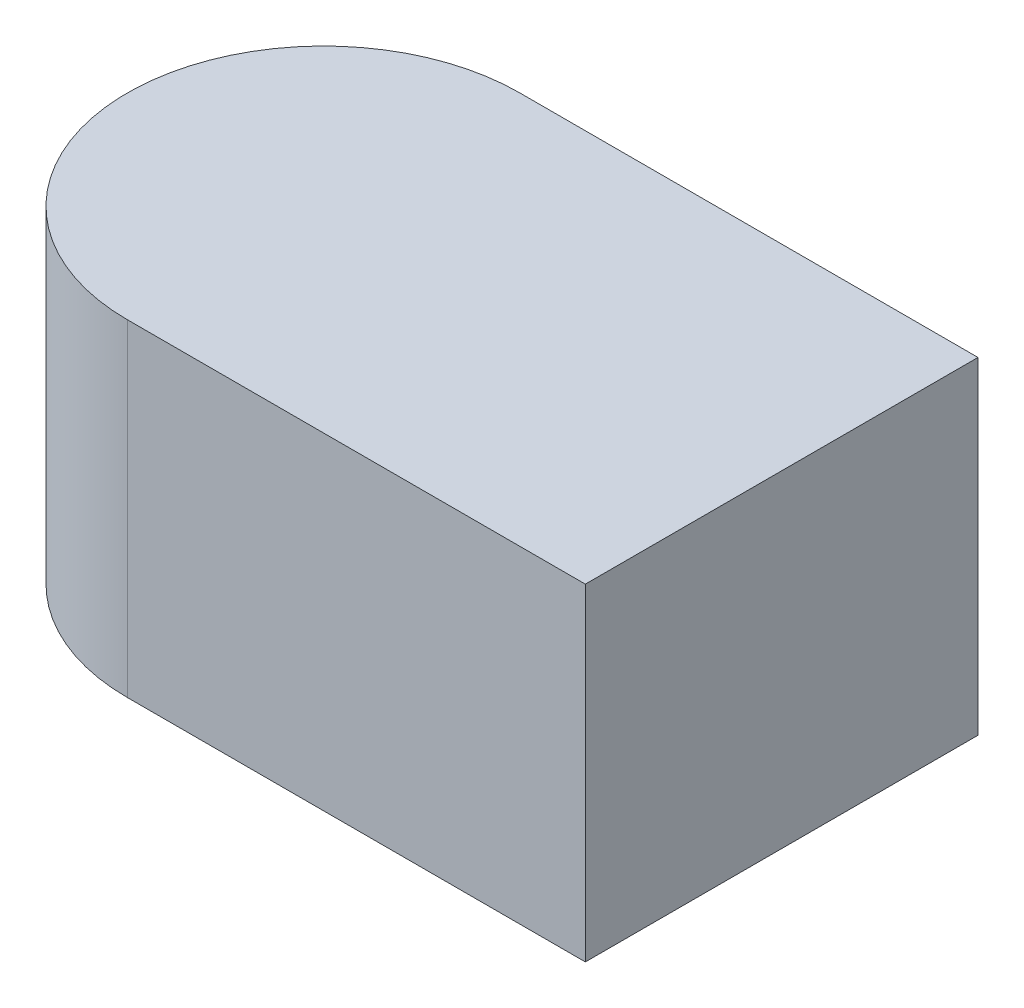
ISO-10303-21;
HEADER;
FILE_DESCRIPTION(('STEP AP214'),'2;1');
FILE_NAME('part.step','',(''),(''),'','','');
FILE_SCHEMA(('AUTOMOTIVE_DESIGN { 1 0 10303 214 1 1 1 1 }'));
ENDSEC;
DATA;
#1=APPLICATION_CONTEXT('core data for automotive mechanical design processes');
#2=APPLICATION_PROTOCOL_DEFINITION('international standard','automotive_design',2000,#1);
#3=PRODUCT_CONTEXT('',#1,'mechanical');
#4=PRODUCT('Part','Part','',(#3));
#5=PRODUCT_RELATED_PRODUCT_CATEGORY('part','',(#4));
#6=PRODUCT_DEFINITION_FORMATION('','',#4);
#7=PRODUCT_DEFINITION_CONTEXT('part definition',#1,'design');
#8=PRODUCT_DEFINITION('design','',#6,#7);
#9=PRODUCT_DEFINITION_SHAPE('','',#8);
#10=(LENGTH_UNIT() NAMED_UNIT(*) SI_UNIT(.MILLI.,.METRE.));
#11=(NAMED_UNIT(*) PLANE_ANGLE_UNIT() SI_UNIT($,.RADIAN.));
#12=(NAMED_UNIT(*) SI_UNIT($,.STERADIAN.) SOLID_ANGLE_UNIT());
#13=UNCERTAINTY_MEASURE_WITH_UNIT(LENGTH_MEASURE(1.E-05),#10,'distance_accuracy_value','');
#14=(GEOMETRIC_REPRESENTATION_CONTEXT(3) GLOBAL_UNCERTAINTY_ASSIGNED_CONTEXT((#13)) GLOBAL_UNIT_ASSIGNED_CONTEXT((#10,
#11,#12)) REPRESENTATION_CONTEXT('',''));
#15=CARTESIAN_POINT('',(0.,0.,0.));
#16=DIRECTION('',(0.,0.,1.));
#17=DIRECTION('',(1.,0.,0.));
#18=AXIS2_PLACEMENT_3D('',#15,#16,#17);
#19=CARTESIAN_POINT('',(0.,0.,0.));
#20=DIRECTION('',(0.,1.,0.));
#21=DIRECTION('',(1.,0.,0.));
#22=AXIS2_PLACEMENT_3D('',#19,#20,#21);
#23=PLANE('',#22);
#24=DIRECTION('',(0.,0.,-1.));
#25=VECTOR('',#24,1.);
#26=CARTESIAN_POINT('',(1.75,0.,0.87));
#27=LINE('',#26,#25);
#28=CARTESIAN_POINT('',(1.75,0.,0.87));
#29=VERTEX_POINT('',#28);
#30=CARTESIAN_POINT('',(1.75,0.,0.63));
#31=VERTEX_POINT('',#30);
#32=EDGE_CURVE('E11',#29,#31,#27,.T.);
#33=ORIENTED_EDGE('',*,*,#32,.F.);
#34=DIRECTION('',(1.,0.,0.));
#35=VECTOR('',#34,1.);
#36=CARTESIAN_POINT('',(1.47,0.,0.87));
#37=LINE('',#36,#35);
#38=CARTESIAN_POINT('',(1.47,0.,0.87));
#39=VERTEX_POINT('',#38);
#40=EDGE_CURVE('E24',#39,#29,#37,.T.);
#41=ORIENTED_EDGE('',*,*,#40,.F.);
#42=CARTESIAN_POINT('',(1.47,0.,0.75));
#43=DIRECTION('',(0.,1.,0.));
#44=DIRECTION('',(0.,0.,-1.));
#45=AXIS2_PLACEMENT_3D('',#42,#43,#44);
#46=CIRCLE('',#45,0.12);
#47=CARTESIAN_POINT('',(1.47,0.,0.63));
#48=VERTEX_POINT('',#47);
#49=EDGE_CURVE('E61',#48,#39,#46,.T.);
#50=ORIENTED_EDGE('',*,*,#49,.F.);
#51=DIRECTION('',(-1.,0.,0.));
#52=VECTOR('',#51,1.);
#53=CARTESIAN_POINT('',(1.75,0.,0.63));
#54=LINE('',#53,#52);
#55=EDGE_CURVE('E37',#31,#48,#54,.T.);
#56=ORIENTED_EDGE('',*,*,#55,.F.);
#57=EDGE_LOOP('',(#33,#41,#50,#56));
#58=FACE_BOUND('',#57,.T.);
#59=ADVANCED_FACE('F17',(#58),#23,.F.);
#60=CARTESIAN_POINT('',(1.75,0.,0.63));
#61=DIRECTION('',(0.,0.,-1.));
#62=DIRECTION('',(-1.,0.,0.));
#63=AXIS2_PLACEMENT_3D('',#60,#61,#62);
#64=PLANE('',#63);
#65=DIRECTION('',(0.,1.,0.));
#66=VECTOR('',#65,1.);
#67=CARTESIAN_POINT('',(1.47,0.,0.63));
#68=LINE('',#67,#66);
#69=CARTESIAN_POINT('',(1.47,0.2,0.63));
#70=VERTEX_POINT('',#69);
#71=EDGE_CURVE('E84',#48,#70,#68,.T.);
#72=ORIENTED_EDGE('',*,*,#71,.T.);
#73=DIRECTION('',(-1.,0.,0.));
#74=VECTOR('',#73,1.);
#75=CARTESIAN_POINT('',(1.75,0.2,0.63));
#76=LINE('',#75,#74);
#77=CARTESIAN_POINT('',(1.75,0.2,0.63));
#78=VERTEX_POINT('',#77);
#79=EDGE_CURVE('E74',#78,#70,#76,.T.);
#80=ORIENTED_EDGE('',*,*,#79,.F.);
#81=DIRECTION('',(0.,1.,0.));
#82=VECTOR('',#81,1.);
#83=CARTESIAN_POINT('',(1.75,0.,0.63));
#84=LINE('',#83,#82);
#85=EDGE_CURVE('E81',#31,#78,#84,.T.);
#86=ORIENTED_EDGE('',*,*,#85,.F.);
#87=ORIENTED_EDGE('',*,*,#55,.T.);
#88=EDGE_LOOP('',(#72,#80,#86,#87));
#89=FACE_BOUND('',#88,.T.);
#90=ADVANCED_FACE('F89',(#89),#64,.T.);
#91=CARTESIAN_POINT('',(1.75,0.,0.87));
#92=DIRECTION('',(1.,0.,0.));
#93=DIRECTION('',(0.,0.,-1.));
#94=AXIS2_PLACEMENT_3D('',#91,#92,#93);
#95=PLANE('',#94);
#96=ORIENTED_EDGE('',*,*,#85,.T.);
#97=DIRECTION('',(0.,0.,-1.));
#98=VECTOR('',#97,1.);
#99=CARTESIAN_POINT('',(1.75,0.2,0.87));
#100=LINE('',#99,#98);
#101=CARTESIAN_POINT('',(1.75,0.2,0.87));
#102=VERTEX_POINT('',#101);
#103=EDGE_CURVE('E79',#102,#78,#100,.T.);
#104=ORIENTED_EDGE('',*,*,#103,.F.);
#105=DIRECTION('',(0.,1.,0.));
#106=VECTOR('',#105,1.);
#107=CARTESIAN_POINT('',(1.75,0.,0.87));
#108=LINE('',#107,#106);
#109=EDGE_CURVE('E67',#29,#102,#108,.T.);
#110=ORIENTED_EDGE('',*,*,#109,.F.);
#111=ORIENTED_EDGE('',*,*,#32,.T.);
#112=EDGE_LOOP('',(#96,#104,#110,#111));
#113=FACE_BOUND('',#112,.T.);
#114=ADVANCED_FACE('F91',(#113),#95,.T.);
#115=CARTESIAN_POINT('',(1.47,0.,0.87));
#116=DIRECTION('',(0.,0.,1.));
#117=DIRECTION('',(1.,0.,0.));
#118=AXIS2_PLACEMENT_3D('',#115,#116,#117);
#119=PLANE('',#118);
#120=ORIENTED_EDGE('',*,*,#109,.T.);
#121=DIRECTION('',(1.,0.,0.));
#122=VECTOR('',#121,1.);
#123=CARTESIAN_POINT('',(1.47,0.2,0.87));
#124=LINE('',#123,#122);
#125=CARTESIAN_POINT('',(1.47,0.2,0.87));
#126=VERTEX_POINT('',#125);
#127=EDGE_CURVE('E62',#126,#102,#124,.T.);
#128=ORIENTED_EDGE('',*,*,#127,.F.);
#129=DIRECTION('',(0.,1.,0.));
#130=VECTOR('',#129,1.);
#131=CARTESIAN_POINT('',(1.47,0.,0.87));
#132=LINE('',#131,#130);
#133=EDGE_CURVE('E55',#39,#126,#132,.T.);
#134=ORIENTED_EDGE('',*,*,#133,.F.);
#135=ORIENTED_EDGE('',*,*,#40,.T.);
#136=EDGE_LOOP('',(#120,#128,#134,#135));
#137=FACE_BOUND('',#136,.T.);
#138=ADVANCED_FACE('F65',(#137),#119,.T.);
#139=CARTESIAN_POINT('',(1.47,0.,0.75));
#140=DIRECTION('',(0.,1.,0.));
#141=DIRECTION('',(1.,0.,0.));
#142=AXIS2_PLACEMENT_3D('',#139,#140,#141);
#143=CYLINDRICAL_SURFACE('',#142,0.12);
#144=ORIENTED_EDGE('',*,*,#133,.T.);
#145=CARTESIAN_POINT('',(1.47,0.2,0.75));
#146=DIRECTION('',(0.,1.,0.));
#147=DIRECTION('',(0.,0.,-1.));
#148=AXIS2_PLACEMENT_3D('',#145,#146,#147);
#149=CIRCLE('',#148,0.12);
#150=EDGE_CURVE('E60',#70,#126,#149,.T.);
#151=ORIENTED_EDGE('',*,*,#150,.F.);
#152=ORIENTED_EDGE('',*,*,#71,.F.);
#153=ORIENTED_EDGE('',*,*,#49,.T.);
#154=EDGE_LOOP('',(#144,#151,#152,#153));
#155=FACE_BOUND('',#154,.T.);
#156=ADVANCED_FACE('F57',(#155),#143,.T.);
#157=CARTESIAN_POINT('',(0.,0.2,0.));
#158=DIRECTION('',(0.,1.,0.));
#159=DIRECTION('',(1.,0.,0.));
#160=AXIS2_PLACEMENT_3D('',#157,#158,#159);
#161=PLANE('',#160);
#162=ORIENTED_EDGE('',*,*,#150,.T.);
#163=ORIENTED_EDGE('',*,*,#127,.T.);
#164=ORIENTED_EDGE('',*,*,#103,.T.);
#165=ORIENTED_EDGE('',*,*,#79,.T.);
#166=EDGE_LOOP('',(#162,#163,#164,#165));
#167=FACE_BOUND('',#166,.T.);
#168=ADVANCED_FACE('F72',(#167),#161,.T.);
#169=CLOSED_SHELL('',(#59,#90,#114,#138,#156,#168));
#170=MANIFOLD_SOLID_BREP('B1',#169);
#171=ADVANCED_BREP_SHAPE_REPRESENTATION('',(#18,#170),#14);
#172=SHAPE_DEFINITION_REPRESENTATION(#9,#171);
ENDSEC;
END-ISO-10303-21;
